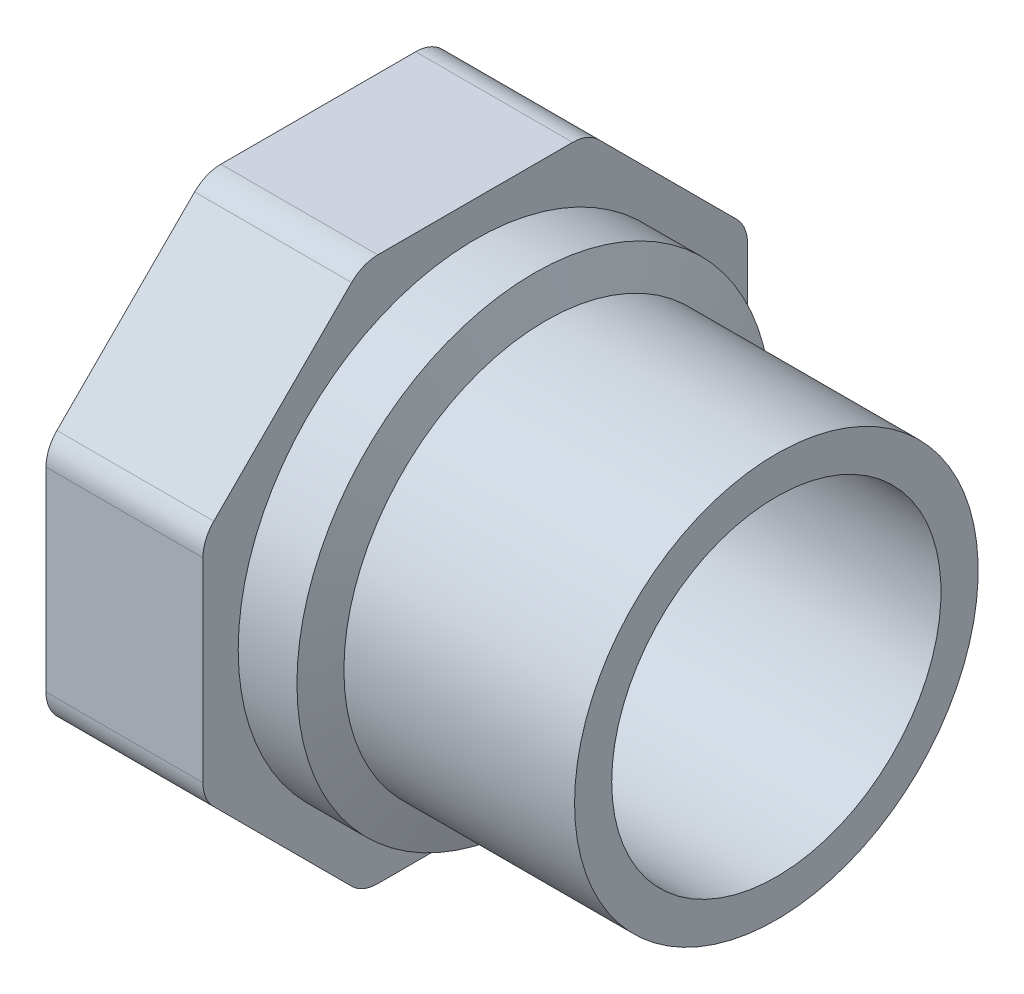
ISO-10303-21;
HEADER;
FILE_DESCRIPTION(('STEP AP214'),'2;1');
FILE_NAME('part.step','',(''),(''),'','','');
FILE_SCHEMA(('AUTOMOTIVE_DESIGN { 1 0 10303 214 1 1 1 1 }'));
ENDSEC;
DATA;
#1=APPLICATION_CONTEXT('core data for automotive mechanical design processes');
#2=APPLICATION_PROTOCOL_DEFINITION('international standard','automotive_design',2000,#1);
#3=PRODUCT_CONTEXT('',#1,'mechanical');
#4=PRODUCT('Part','Part','',(#3));
#5=PRODUCT_RELATED_PRODUCT_CATEGORY('part','',(#4));
#6=PRODUCT_DEFINITION_FORMATION('','',#4);
#7=PRODUCT_DEFINITION_CONTEXT('part definition',#1,'design');
#8=PRODUCT_DEFINITION('design','',#6,#7);
#9=PRODUCT_DEFINITION_SHAPE('','',#8);
#10=(LENGTH_UNIT() NAMED_UNIT(*) SI_UNIT(.MILLI.,.METRE.));
#11=(NAMED_UNIT(*) PLANE_ANGLE_UNIT() SI_UNIT($,.RADIAN.));
#12=(NAMED_UNIT(*) SI_UNIT($,.STERADIAN.) SOLID_ANGLE_UNIT());
#13=UNCERTAINTY_MEASURE_WITH_UNIT(LENGTH_MEASURE(1.E-05),#10,'distance_accuracy_value','');
#14=(GEOMETRIC_REPRESENTATION_CONTEXT(3) GLOBAL_UNCERTAINTY_ASSIGNED_CONTEXT((#13)) GLOBAL_UNIT_ASSIGNED_CONTEXT((#10,
#11,#12)) REPRESENTATION_CONTEXT('',''));
#15=CARTESIAN_POINT('',(0.,0.,0.));
#16=DIRECTION('',(0.,0.,1.));
#17=DIRECTION('',(1.,0.,0.));
#18=AXIS2_PLACEMENT_3D('',#15,#16,#17);
#19=CARTESIAN_POINT('',(-36.,0.,0.));
#20=DIRECTION('',(-1.,0.,0.));
#21=DIRECTION('',(0.,0.,1.));
#22=AXIS2_PLACEMENT_3D('',#19,#20,#21);
#23=CYLINDRICAL_SURFACE('',#22,31.5);
#24=CARTESIAN_POINT('',(-36.,0.,0.));
#25=DIRECTION('',(1.,0.,0.));
#26=DIRECTION('',(0.,1.,0.));
#27=AXIS2_PLACEMENT_3D('',#24,#25,#26);
#28=CIRCLE('',#27,31.5);
#29=CARTESIAN_POINT('',(-36.,31.5,0.));
#30=VERTEX_POINT('',#29);
#31=EDGE_CURVE('E193',#30,#30,#28,.F.);
#32=ORIENTED_EDGE('',*,*,#31,.F.);
#33=EDGE_LOOP('',(#32));
#34=FACE_BOUND('',#33,.T.);
#35=CARTESIAN_POINT('',(0.,0.,0.));
#36=DIRECTION('',(-1.,0.,0.));
#37=DIRECTION('',(0.,0.,1.));
#38=AXIS2_PLACEMENT_3D('',#35,#36,#37);
#39=CIRCLE('',#38,31.5);
#40=CARTESIAN_POINT('',(0.,0.,31.5));
#41=VERTEX_POINT('',#40);
#42=EDGE_CURVE('E18',#41,#41,#39,.F.);
#43=ORIENTED_EDGE('',*,*,#42,.F.);
#44=EDGE_LOOP('',(#43));
#45=FACE_BOUND('',#44,.T.);
#46=ADVANCED_FACE('F15',(#34,#45),#23,.T.);
#47=CARTESIAN_POINT('',(-36.,0.,0.));
#48=DIRECTION('',(-1.,0.,0.));
#49=DIRECTION('',(0.,0.,1.));
#50=AXIS2_PLACEMENT_3D('',#47,#48,#49);
#51=CONICAL_SURFACE('',#50,31.5,1.24904577239825);
#52=CARTESIAN_POINT('',(-37.8333333333333,0.,0.));
#53=DIRECTION('',(-1.,0.,0.));
#54=DIRECTION('',(0.,1.,0.));
#55=AXIS2_PLACEMENT_3D('',#52,#53,#54);
#56=CIRCLE('',#55,37.);
#57=CARTESIAN_POINT('',(-37.8333333333333,37.,0.));
#58=VERTEX_POINT('',#57);
#59=EDGE_CURVE('E189',#58,#58,#56,.T.);
#60=ORIENTED_EDGE('',*,*,#59,.F.);
#61=EDGE_LOOP('',(#60));
#62=FACE_BOUND('',#61,.T.);
#63=ORIENTED_EDGE('',*,*,#31,.T.);
#64=EDGE_LOOP('',(#63));
#65=FACE_BOUND('',#64,.T.);
#66=ADVANCED_FACE('F268',(#62,#65),#51,.T.);
#67=CARTESIAN_POINT('',(0.,31.5,31.8780010540613));
#68=DIRECTION('',(1.,0.,0.));
#69=DIRECTION('',(0.,-1.,0.));
#70=AXIS2_PLACEMENT_3D('',#67,#68,#69);
#71=PLANE('',#70);
#72=CARTESIAN_POINT('',(0.,0.,0.));
#73=DIRECTION('',(-1.,0.,0.));
#74=DIRECTION('',(0.,0.,1.));
#75=AXIS2_PLACEMENT_3D('',#72,#73,#74);
#76=CIRCLE('',#75,25.7);
#77=CARTESIAN_POINT('',(0.,0.,25.7));
#78=VERTEX_POINT('',#77);
#79=EDGE_CURVE('E192',#78,#78,#76,.F.);
#80=ORIENTED_EDGE('',*,*,#79,.F.);
#81=EDGE_LOOP('',(#80));
#82=FACE_BOUND('',#81,.T.);
#83=ORIENTED_EDGE('',*,*,#42,.T.);
#84=EDGE_LOOP('',(#83));
#85=FACE_BOUND('',#84,.T.);
#86=ADVANCED_FACE('F264',(#82,#85),#71,.T.);
#87=CARTESIAN_POINT('',(-47.,0.,0.));
#88=DIRECTION('',(-1.,0.,0.));
#89=DIRECTION('',(0.,0.,1.));
#90=AXIS2_PLACEMENT_3D('',#87,#88,#89);
#91=CYLINDRICAL_SURFACE('',#90,37.);
#92=CARTESIAN_POINT('',(-47.,0.,0.));
#93=DIRECTION('',(-1.,0.,0.));
#94=DIRECTION('',(0.,0.,1.));
#95=AXIS2_PLACEMENT_3D('',#92,#93,#94);
#96=CIRCLE('',#95,37.);
#97=CARTESIAN_POINT('',(-47.,0.,37.));
#98=VERTEX_POINT('',#97);
#99=EDGE_CURVE('E188',#98,#98,#96,.T.);
#100=ORIENTED_EDGE('',*,*,#99,.F.);
#101=EDGE_LOOP('',(#100));
#102=FACE_BOUND('',#101,.T.);
#103=ORIENTED_EDGE('',*,*,#59,.T.);
#104=EDGE_LOOP('',(#103));
#105=FACE_BOUND('',#104,.T.);
#106=ADVANCED_FACE('F267',(#102,#105),#91,.T.);
#107=CARTESIAN_POINT('',(0.,0.,0.));
#108=DIRECTION('',(-1.,0.,0.));
#109=DIRECTION('',(0.,0.,1.));
#110=AXIS2_PLACEMENT_3D('',#107,#108,#109);
#111=CYLINDRICAL_SURFACE('',#110,25.7);
#112=ORIENTED_EDGE('',*,*,#79,.T.);
#113=EDGE_LOOP('',(#112));
#114=FACE_BOUND('',#113,.T.);
#115=CARTESIAN_POINT('',(-46.1528349610431,0.,0.));
#116=DIRECTION('',(1.,0.,0.));
#117=DIRECTION('',(0.,1.,0.));
#118=AXIS2_PLACEMENT_3D('',#115,#116,#117);
#119=CIRCLE('',#118,25.7);
#120=CARTESIAN_POINT('',(-46.1528349610431,25.7,0.));
#121=VERTEX_POINT('',#120);
#122=EDGE_CURVE('E135',#121,#121,#119,.T.);
#123=ORIENTED_EDGE('',*,*,#122,.F.);
#124=EDGE_LOOP('',(#123));
#125=FACE_BOUND('',#124,.T.);
#126=ADVANCED_FACE('F261',(#114,#125),#111,.F.);
#127=CARTESIAN_POINT('',(-47.,42.5,42.5));
#128=DIRECTION('',(1.,0.,0.));
#129=DIRECTION('',(0.,-1.,0.));
#130=AXIS2_PLACEMENT_3D('',#127,#128,#129);
#131=PLANE('',#130);
#132=ORIENTED_EDGE('',*,*,#99,.T.);
#133=EDGE_LOOP('',(#132));
#134=FACE_BOUND('',#133,.T.);
#135=CARTESIAN_POINT('',(-47.,15.2016377390926,36.7));
#136=DIRECTION('',(1.,0.,0.));
#137=DIRECTION('',(0.,0.,-1.));
#138=AXIS2_PLACEMENT_3D('',#135,#136,#137);
#139=CIRCLE('',#138,5.79999999999997);
#140=CARTESIAN_POINT('',(-47.,15.2016377390926,42.5));
#141=VERTEX_POINT('',#140);
#142=CARTESIAN_POINT('',(-47.,19.3028570699746,40.801219330882));
#143=VERTEX_POINT('',#142);
#144=EDGE_CURVE('E254',#141,#143,#139,.F.);
#145=ORIENTED_EDGE('',*,*,#144,.F.);
#146=DIRECTION('',(0.,1.,0.));
#147=VECTOR('',#146,1.);
#148=CARTESIAN_POINT('',(-47.,0.,42.5));
#149=LINE('',#148,#147);
#150=CARTESIAN_POINT('',(-47.,-15.2016377390926,42.5));
#151=VERTEX_POINT('',#150);
#152=EDGE_CURVE('E132',#151,#141,#149,.T.);
#153=ORIENTED_EDGE('',*,*,#152,.F.);
#154=CARTESIAN_POINT('',(-47.,-15.2016377390926,36.7));
#155=DIRECTION('',(1.,0.,0.));
#156=DIRECTION('',(0.,0.,-1.));
#157=AXIS2_PLACEMENT_3D('',#154,#155,#156);
#158=CIRCLE('',#157,5.79999999999998);
#159=CARTESIAN_POINT('',(-47.,-19.3028570699746,40.801219330882));
#160=VERTEX_POINT('',#159);
#161=EDGE_CURVE('E126',#160,#151,#158,.F.);
#162=ORIENTED_EDGE('',*,*,#161,.F.);
#163=DIRECTION('',(0.,0.707106781186547,0.707106781186548));
#164=VECTOR('',#163,1.);
#165=CARTESIAN_POINT('',(-47.,-30.0520382004283,30.0520382004283));
#166=LINE('',#165,#164);
#167=CARTESIAN_POINT('',(-47.,-40.801219330882,19.3028570699745));
#168=VERTEX_POINT('',#167);
#169=EDGE_CURVE('E130',#168,#160,#166,.T.);
#170=ORIENTED_EDGE('',*,*,#169,.F.);
#171=CARTESIAN_POINT('',(-47.,-36.7,15.2016377390926));
#172=DIRECTION('',(1.,0.,0.));
#173=DIRECTION('',(0.,0.,-1.));
#174=AXIS2_PLACEMENT_3D('',#171,#172,#173);
#175=CIRCLE('',#174,5.8);
#176=CARTESIAN_POINT('',(-47.,-42.5,15.2016377390926));
#177=VERTEX_POINT('',#176);
#178=EDGE_CURVE('E149',#177,#168,#175,.F.);
#179=ORIENTED_EDGE('',*,*,#178,.F.);
#180=DIRECTION('',(0.,0.,1.));
#181=VECTOR('',#180,1.);
#182=CARTESIAN_POINT('',(-47.,-42.5,0.));
#183=LINE('',#182,#181);
#184=CARTESIAN_POINT('',(-47.,-42.5,-15.2016377390926));
#185=VERTEX_POINT('',#184);
#186=EDGE_CURVE('E154',#185,#177,#183,.T.);
#187=ORIENTED_EDGE('',*,*,#186,.F.);
#188=CARTESIAN_POINT('',(-47.,-36.7,-15.2016377390926));
#189=DIRECTION('',(1.,0.,0.));
#190=DIRECTION('',(0.,0.,-1.));
#191=AXIS2_PLACEMENT_3D('',#188,#189,#190);
#192=CIRCLE('',#191,5.8);
#193=CARTESIAN_POINT('',(-47.,-40.801219330882,-19.3028570699746));
#194=VERTEX_POINT('',#193);
#195=EDGE_CURVE('E239',#194,#185,#192,.F.);
#196=ORIENTED_EDGE('',*,*,#195,.F.);
#197=DIRECTION('',(0.,-0.707106781186548,0.707106781186547));
#198=VECTOR('',#197,1.);
#199=CARTESIAN_POINT('',(-47.,-30.0520382004282,-30.0520382004283));
#200=LINE('',#199,#198);
#201=CARTESIAN_POINT('',(-47.,-19.3028570699745,-40.801219330882));
#202=VERTEX_POINT('',#201);
#203=EDGE_CURVE('E159',#202,#194,#200,.T.);
#204=ORIENTED_EDGE('',*,*,#203,.F.);
#205=CARTESIAN_POINT('',(-47.,-15.2016377390926,-36.7));
#206=DIRECTION('',(1.,0.,0.));
#207=DIRECTION('',(0.,0.,-1.));
#208=AXIS2_PLACEMENT_3D('',#205,#206,#207);
#209=CIRCLE('',#208,5.80000000000003);
#210=CARTESIAN_POINT('',(-47.,-15.2016377390926,-42.5));
#211=VERTEX_POINT('',#210);
#212=EDGE_CURVE('E242',#211,#202,#209,.F.);
#213=ORIENTED_EDGE('',*,*,#212,.F.);
#214=DIRECTION('',(0.,-1.,0.));
#215=VECTOR('',#214,1.);
#216=CARTESIAN_POINT('',(-47.,0.,-42.5));
#217=LINE('',#216,#215);
#218=CARTESIAN_POINT('',(-47.,15.2016377390926,-42.5));
#219=VERTEX_POINT('',#218);
#220=EDGE_CURVE('E164',#219,#211,#217,.T.);
#221=ORIENTED_EDGE('',*,*,#220,.F.);
#222=CARTESIAN_POINT('',(-47.,15.2016377390926,-36.7000000000001));
#223=DIRECTION('',(1.,0.,0.));
#224=DIRECTION('',(0.,0.,-1.));
#225=AXIS2_PLACEMENT_3D('',#222,#223,#224);
#226=CIRCLE('',#225,5.79999999999994);
#227=CARTESIAN_POINT('',(-47.,19.3028570699746,-40.801219330882));
#228=VERTEX_POINT('',#227);
#229=EDGE_CURVE('E245',#228,#219,#226,.F.);
#230=ORIENTED_EDGE('',*,*,#229,.F.);
#231=DIRECTION('',(0.,-0.707106781186547,-0.707106781186548));
#232=VECTOR('',#231,1.);
#233=CARTESIAN_POINT('',(-47.,30.0520382004283,-30.0520382004283));
#234=LINE('',#233,#232);
#235=CARTESIAN_POINT('',(-47.,40.801219330882,-19.3028570699746));
#236=VERTEX_POINT('',#235);
#237=EDGE_CURVE('E169',#236,#228,#234,.T.);
#238=ORIENTED_EDGE('',*,*,#237,.F.);
#239=CARTESIAN_POINT('',(-47.,36.7,-15.2016377390926));
#240=DIRECTION('',(1.,0.,0.));
#241=DIRECTION('',(0.,0.,-1.));
#242=AXIS2_PLACEMENT_3D('',#239,#240,#241);
#243=CIRCLE('',#242,5.80000000000001);
#244=CARTESIAN_POINT('',(-47.,42.5,-15.2016377390926));
#245=VERTEX_POINT('',#244);
#246=EDGE_CURVE('E248',#245,#236,#243,.F.);
#247=ORIENTED_EDGE('',*,*,#246,.F.);
#248=DIRECTION('',(0.,0.,-1.));
#249=VECTOR('',#248,1.);
#250=CARTESIAN_POINT('',(-47.,42.5,0.));
#251=LINE('',#250,#249);
#252=CARTESIAN_POINT('',(-47.,42.5,15.2016377390926));
#253=VERTEX_POINT('',#252);
#254=EDGE_CURVE('E174',#253,#245,#251,.T.);
#255=ORIENTED_EDGE('',*,*,#254,.F.);
#256=CARTESIAN_POINT('',(-47.,36.7,15.2016377390926));
#257=DIRECTION('',(1.,0.,0.));
#258=DIRECTION('',(0.,0.,-1.));
#259=AXIS2_PLACEMENT_3D('',#256,#257,#258);
#260=CIRCLE('',#259,5.8);
#261=CARTESIAN_POINT('',(-47.,40.801219330882,19.3028570699746));
#262=VERTEX_POINT('',#261);
#263=EDGE_CURVE('E251',#262,#253,#260,.F.);
#264=ORIENTED_EDGE('',*,*,#263,.F.);
#265=DIRECTION('',(0.,0.707106781186548,-0.707106781186547));
#266=VECTOR('',#265,1.);
#267=CARTESIAN_POINT('',(-47.,30.0520382004283,30.0520382004283));
#268=LINE('',#267,#266);
#269=EDGE_CURVE('E179',#143,#262,#268,.T.);
#270=ORIENTED_EDGE('',*,*,#269,.F.);
#271=EDGE_LOOP('',(#145,#153,#162,#170,#179,#187,#196,#204,#213,#221,#230,#238,#247,#255,#264,#270));
#272=FACE_BOUND('',#271,.T.);
#273=ADVANCED_FACE('F128',(#134,#272),#131,.T.);
#274=CARTESIAN_POINT('',(-47.,0.,0.));
#275=DIRECTION('',(-1.,0.,0.));
#276=DIRECTION('',(0.,0.,1.));
#277=AXIS2_PLACEMENT_3D('',#274,#275,#276);
#278=CONICAL_SURFACE('',#277,27.1673328898693,1.04719755119659);
#279=ORIENTED_EDGE('',*,*,#122,.T.);
#280=EDGE_LOOP('',(#279));
#281=FACE_BOUND('',#280,.T.);
#282=CARTESIAN_POINT('',(-47.,0.,0.));
#283=DIRECTION('',(1.,0.,0.));
#284=DIRECTION('',(0.,1.,0.));
#285=AXIS2_PLACEMENT_3D('',#282,#283,#284);
#286=CIRCLE('',#285,27.1673328898693);
#287=CARTESIAN_POINT('',(-47.,27.1673328898693,0.));
#288=VERTEX_POINT('',#287);
#289=EDGE_CURVE('E153',#288,#288,#286,.T.);
#290=ORIENTED_EDGE('',*,*,#289,.F.);
#291=EDGE_LOOP('',(#290));
#292=FACE_BOUND('',#291,.T.);
#293=ADVANCED_FACE('F438',(#281,#292),#278,.F.);
#294=CARTESIAN_POINT('',(-47.,-15.2016377390926,36.7));
#295=DIRECTION('',(1.,0.,0.));
#296=DIRECTION('',(0.,0.,-1.));
#297=AXIS2_PLACEMENT_3D('',#294,#295,#296);
#298=CYLINDRICAL_SURFACE('',#297,5.79999999999998);
#299=CARTESIAN_POINT('',(-71.5,-15.2016377390926,36.7));
#300=DIRECTION('',(1.,0.,0.));
#301=DIRECTION('',(0.,0.,-1.));
#302=AXIS2_PLACEMENT_3D('',#299,#300,#301);
#303=CIRCLE('',#302,5.79999999999998);
#304=CARTESIAN_POINT('',(-71.5,-19.3028570699746,40.801219330882));
#305=VERTEX_POINT('',#304);
#306=CARTESIAN_POINT('',(-71.5,-15.2016377390926,42.5));
#307=VERTEX_POINT('',#306);
#308=EDGE_CURVE('E141',#305,#307,#303,.F.);
#309=ORIENTED_EDGE('',*,*,#308,.F.);
#310=DIRECTION('',(1.,0.,0.));
#311=VECTOR('',#310,1.);
#312=CARTESIAN_POINT('',(-71.5,-19.3028570699746,40.801219330882));
#313=LINE('',#312,#311);
#314=EDGE_CURVE('E138',#160,#305,#313,.F.);
#315=ORIENTED_EDGE('',*,*,#314,.F.);
#316=ORIENTED_EDGE('',*,*,#161,.T.);
#317=DIRECTION('',(1.,0.,0.));
#318=VECTOR('',#317,1.);
#319=CARTESIAN_POINT('',(-71.5,-15.2016377390926,42.5));
#320=LINE('',#319,#318);
#321=EDGE_CURVE('E185',#307,#151,#320,.T.);
#322=ORIENTED_EDGE('',*,*,#321,.F.);
#323=EDGE_LOOP('',(#309,#315,#316,#322));
#324=FACE_BOUND('',#323,.T.);
#325=ADVANCED_FACE('F139',(#324),#298,.T.);
#326=CARTESIAN_POINT('',(-71.5,15.2016377390926,42.5));
#327=DIRECTION('',(0.,0.,1.));
#328=DIRECTION('',(0.,-1.,0.));
#329=AXIS2_PLACEMENT_3D('',#326,#327,#328);
#330=PLANE('',#329);
#331=DIRECTION('',(0.,1.,0.));
#332=VECTOR('',#331,1.);
#333=CARTESIAN_POINT('',(-71.5,0.,42.5));
#334=LINE('',#333,#332);
#335=CARTESIAN_POINT('',(-71.5,15.2016377390926,42.5));
#336=VERTEX_POINT('',#335);
#337=EDGE_CURVE('E236',#307,#336,#334,.T.);
#338=ORIENTED_EDGE('',*,*,#337,.F.);
#339=ORIENTED_EDGE('',*,*,#321,.T.);
#340=ORIENTED_EDGE('',*,*,#152,.T.);
#341=DIRECTION('',(1.,0.,0.));
#342=VECTOR('',#341,1.);
#343=CARTESIAN_POINT('',(-59.25,15.2016377390926,42.5));
#344=LINE('',#343,#342);
#345=EDGE_CURVE('E183',#336,#141,#344,.T.);
#346=ORIENTED_EDGE('',*,*,#345,.F.);
#347=EDGE_LOOP('',(#338,#339,#340,#346));
#348=FACE_BOUND('',#347,.T.);
#349=ADVANCED_FACE('F387',(#348),#330,.T.);
#350=CARTESIAN_POINT('',(-47.,15.2016377390926,36.7));
#351=DIRECTION('',(1.,0.,0.));
#352=DIRECTION('',(0.,0.,-1.));
#353=AXIS2_PLACEMENT_3D('',#350,#351,#352);
#354=CYLINDRICAL_SURFACE('',#353,5.79999999999997);
#355=CARTESIAN_POINT('',(-71.5,15.2016377390926,36.7));
#356=DIRECTION('',(1.,0.,0.));
#357=DIRECTION('',(0.,0.,-1.));
#358=AXIS2_PLACEMENT_3D('',#355,#356,#357);
#359=CIRCLE('',#358,5.79999999999997);
#360=CARTESIAN_POINT('',(-71.5,19.3028570699746,40.801219330882));
#361=VERTEX_POINT('',#360);
#362=EDGE_CURVE('E233',#336,#361,#359,.F.);
#363=ORIENTED_EDGE('',*,*,#362,.F.);
#364=ORIENTED_EDGE('',*,*,#345,.T.);
#365=ORIENTED_EDGE('',*,*,#144,.T.);
#366=DIRECTION('',(1.,0.,0.));
#367=VECTOR('',#366,1.);
#368=CARTESIAN_POINT('',(-71.5,19.3028570699746,40.801219330882));
#369=LINE('',#368,#367);
#370=EDGE_CURVE('E182',#361,#143,#369,.T.);
#371=ORIENTED_EDGE('',*,*,#370,.F.);
#372=EDGE_LOOP('',(#363,#364,#365,#371));
#373=FACE_BOUND('',#372,.T.);
#374=ADVANCED_FACE('F425',(#373),#354,.T.);
#375=CARTESIAN_POINT('',(-71.5,40.801219330882,19.3028570699746));
#376=DIRECTION('',(0.,0.707106781186547,0.707106781186548));
#377=DIRECTION('',(0.,-0.707106781186548,0.707106781186547));
#378=AXIS2_PLACEMENT_3D('',#375,#376,#377);
#379=PLANE('',#378);
#380=CARTESIAN_POINT('',(-71.5,19.3028570699746,40.801219330882));
#381=CARTESIAN_POINT('',(-71.5,20.1986221641791,39.9054542366775));
#382=CARTESIAN_POINT('',(-71.5,21.0943872583835,39.0096891424731));
#383=CARTESIAN_POINT('',(-71.5,22.8859174467925,37.2181589540641));
#384=CARTESIAN_POINT('',(-71.5,23.7816825409969,36.3223938598596));
#385=CARTESIAN_POINT('',(-71.5,25.5732127294059,34.5308636714507));
#386=CARTESIAN_POINT('',(-71.5,26.4689778236104,33.6350985772462));
#387=CARTESIAN_POINT('',(-71.5,28.2605080120193,31.8435683888372));
#388=CARTESIAN_POINT('',(-71.5,29.1562731062238,30.9478032946328));
#389=CARTESIAN_POINT('',(-71.5,30.9478032946327,29.1562731062238));
#390=CARTESIAN_POINT('',(-71.5,31.8435683888372,28.2605080120193));
#391=CARTESIAN_POINT('',(-71.5,33.6350985772462,26.4689778236104));
#392=CARTESIAN_POINT('',(-71.5,34.5308636714507,25.5732127294059));
#393=CARTESIAN_POINT('',(-71.5,36.3223938598596,23.781682540997));
#394=CARTESIAN_POINT('',(-71.5,37.2181589540641,22.8859174467925));
#395=CARTESIAN_POINT('',(-71.5,39.009689142473,21.0943872583835));
#396=CARTESIAN_POINT('',(-71.5,39.9054542366775,20.198622164179));
#397=CARTESIAN_POINT('',(-71.5,40.801219330882,19.3028570699746));
#398=B_SPLINE_CURVE_WITH_KNOTS('',3,(#380,#381,#382,#383,#384,#385,#386,#387,#388,#389,#390,
#391,#392,#393,#394,#395,#396,#397),.UNSPECIFIED.,.F.,.F.,(4,2,2,2,2,2,2,2,4),(0.,
3.80040943477315,7.60081886954629,11.4012283043195,15.2016377390926,19.0020471738657,
22.8024566086389,26.602866043412,30.4032754781852),.UNSPECIFIED.);
#399=CARTESIAN_POINT('',(-71.5,40.801219330882,19.3028570699746));
#400=VERTEX_POINT('',#399);
#401=EDGE_CURVE('E232',#361,#400,#398,.T.);
#402=ORIENTED_EDGE('',*,*,#401,.F.);
#403=ORIENTED_EDGE('',*,*,#370,.T.);
#404=ORIENTED_EDGE('',*,*,#269,.T.);
#405=DIRECTION('',(1.,0.,0.));
#406=VECTOR('',#405,1.);
#407=CARTESIAN_POINT('',(-59.25,40.801219330882,19.3028570699746));
#408=LINE('',#407,#406);
#409=EDGE_CURVE('E178',#400,#262,#408,.T.);
#410=ORIENTED_EDGE('',*,*,#409,.F.);
#411=EDGE_LOOP('',(#402,#403,#404,#410));
#412=FACE_BOUND('',#411,.T.);
#413=ADVANCED_FACE('F423',(#412),#379,.T.);
#414=CARTESIAN_POINT('',(-47.,36.7,15.2016377390926));
#415=DIRECTION('',(1.,0.,0.));
#416=DIRECTION('',(0.,0.,-1.));
#417=AXIS2_PLACEMENT_3D('',#414,#415,#416);
#418=CYLINDRICAL_SURFACE('',#417,5.8);
#419=CARTESIAN_POINT('',(-71.5,36.7,15.2016377390926));
#420=DIRECTION('',(1.,0.,0.));
#421=DIRECTION('',(0.,0.,-1.));
#422=AXIS2_PLACEMENT_3D('',#419,#420,#421);
#423=CIRCLE('',#422,5.8);
#424=CARTESIAN_POINT('',(-71.5,42.5,15.2016377390926));
#425=VERTEX_POINT('',#424);
#426=EDGE_CURVE('E229',#400,#425,#423,.F.);
#427=ORIENTED_EDGE('',*,*,#426,.F.);
#428=ORIENTED_EDGE('',*,*,#409,.T.);
#429=ORIENTED_EDGE('',*,*,#263,.T.);
#430=DIRECTION('',(1.,0.,0.));
#431=VECTOR('',#430,1.);
#432=CARTESIAN_POINT('',(-71.5,42.5,15.2016377390926));
#433=LINE('',#432,#431);
#434=EDGE_CURVE('E177',#425,#253,#433,.T.);
#435=ORIENTED_EDGE('',*,*,#434,.F.);
#436=EDGE_LOOP('',(#427,#428,#429,#435));
#437=FACE_BOUND('',#436,.T.);
#438=ADVANCED_FACE('F420',(#437),#418,.T.);
#439=CARTESIAN_POINT('',(-71.5,42.5,-15.2016377390926));
#440=DIRECTION('',(0.,1.,0.));
#441=DIRECTION('',(0.,0.,1.));
#442=AXIS2_PLACEMENT_3D('',#439,#440,#441);
#443=PLANE('',#442);
#444=DIRECTION('',(0.,0.,-1.));
#445=VECTOR('',#444,1.);
#446=CARTESIAN_POINT('',(-71.5,42.5,42.5));
#447=LINE('',#446,#445);
#448=CARTESIAN_POINT('',(-71.5,42.5,-15.2016377390926));
#449=VERTEX_POINT('',#448);
#450=EDGE_CURVE('E228',#425,#449,#447,.T.);
#451=ORIENTED_EDGE('',*,*,#450,.F.);
#452=ORIENTED_EDGE('',*,*,#434,.T.);
#453=ORIENTED_EDGE('',*,*,#254,.T.);
#454=DIRECTION('',(1.,0.,0.));
#455=VECTOR('',#454,1.);
#456=CARTESIAN_POINT('',(-59.25,42.5,-15.2016377390926));
#457=LINE('',#456,#455);
#458=EDGE_CURVE('E173',#449,#245,#457,.T.);
#459=ORIENTED_EDGE('',*,*,#458,.F.);
#460=EDGE_LOOP('',(#451,#452,#453,#459));
#461=FACE_BOUND('',#460,.T.);
#462=ADVANCED_FACE('F417',(#461),#443,.T.);
#463=CARTESIAN_POINT('',(-47.,36.7,-15.2016377390926));
#464=DIRECTION('',(1.,0.,0.));
#465=DIRECTION('',(0.,0.,-1.));
#466=AXIS2_PLACEMENT_3D('',#463,#464,#465);
#467=CYLINDRICAL_SURFACE('',#466,5.80000000000001);
#468=CARTESIAN_POINT('',(-71.5,36.7,-15.2016377390926));
#469=DIRECTION('',(1.,0.,0.));
#470=DIRECTION('',(0.,0.,-1.));
#471=AXIS2_PLACEMENT_3D('',#468,#469,#470);
#472=CIRCLE('',#471,5.80000000000001);
#473=CARTESIAN_POINT('',(-71.5,40.801219330882,-19.3028570699745));
#474=VERTEX_POINT('',#473);
#475=EDGE_CURVE('E225',#449,#474,#472,.F.);
#476=ORIENTED_EDGE('',*,*,#475,.F.);
#477=ORIENTED_EDGE('',*,*,#458,.T.);
#478=ORIENTED_EDGE('',*,*,#246,.T.);
#479=DIRECTION('',(1.,0.,0.));
#480=VECTOR('',#479,1.);
#481=CARTESIAN_POINT('',(-71.5,40.801219330882,-19.3028570699745));
#482=LINE('',#481,#480);
#483=EDGE_CURVE('E172',#474,#236,#482,.T.);
#484=ORIENTED_EDGE('',*,*,#483,.F.);
#485=EDGE_LOOP('',(#476,#477,#478,#484));
#486=FACE_BOUND('',#485,.T.);
#487=ADVANCED_FACE('F414',(#486),#467,.T.);
#488=CARTESIAN_POINT('',(-71.5,19.3028570699746,-40.801219330882));
#489=DIRECTION('',(0.,0.707106781186548,-0.707106781186547));
#490=DIRECTION('',(0.,0.707106781186547,0.707106781186548));
#491=AXIS2_PLACEMENT_3D('',#488,#489,#490);
#492=PLANE('',#491);
#493=CARTESIAN_POINT('',(-71.5,40.801219330882,-19.3028570699745));
#494=CARTESIAN_POINT('',(-71.5,39.9054542366775,-20.198622164179));
#495=CARTESIAN_POINT('',(-71.5,39.009689142473,-21.0943872583835));
#496=CARTESIAN_POINT('',(-71.5,37.2181589540641,-22.8859174467924));
#497=CARTESIAN_POINT('',(-71.5,36.3223938598596,-23.7816825409969));
#498=CARTESIAN_POINT('',(-71.5,34.5308636714507,-25.5732127294059));
#499=CARTESIAN_POINT('',(-71.5,33.6350985772462,-26.4689778236104));
#500=CARTESIAN_POINT('',(-71.5,31.8435683888372,-28.2605080120193));
#501=CARTESIAN_POINT('',(-71.5,30.9478032946328,-29.1562731062238));
#502=CARTESIAN_POINT('',(-71.5,29.1562731062238,-30.9478032946327));
#503=CARTESIAN_POINT('',(-71.5,28.2605080120193,-31.8435683888372));
#504=CARTESIAN_POINT('',(-71.5,26.4689778236104,-33.6350985772462));
#505=CARTESIAN_POINT('',(-71.5,25.5732127294059,-34.5308636714506));
#506=CARTESIAN_POINT('',(-71.5,23.781682540997,-36.3223938598596));
#507=CARTESIAN_POINT('',(-71.5,22.8859174467925,-37.2181589540641));
#508=CARTESIAN_POINT('',(-71.5,21.0943872583835,-39.0096891424731));
#509=CARTESIAN_POINT('',(-71.5,20.1986221641791,-39.9054542366775));
#510=CARTESIAN_POINT('',(-71.5,19.3028570699746,-40.801219330882));
#511=B_SPLINE_CURVE_WITH_KNOTS('',3,(#493,#494,#495,#496,#497,#498,#499,#500,#501,#502,#503,
#504,#505,#506,#507,#508,#509,#510),.UNSPECIFIED.,.F.,.F.,(4,2,2,2,2,2,2,2,4),(0.,
3.80040943477314,7.6008188695463,11.4012283043195,15.2016377390926,19.0020471738657,
22.8024566086389,26.6028660434121,30.4032754781852),.UNSPECIFIED.);
#512=CARTESIAN_POINT('',(-71.5,19.3028570699746,-40.801219330882));
#513=VERTEX_POINT('',#512);
#514=EDGE_CURVE('E224',#474,#513,#511,.T.);
#515=ORIENTED_EDGE('',*,*,#514,.F.);
#516=ORIENTED_EDGE('',*,*,#483,.T.);
#517=ORIENTED_EDGE('',*,*,#237,.T.);
#518=DIRECTION('',(1.,0.,0.));
#519=VECTOR('',#518,1.);
#520=CARTESIAN_POINT('',(-59.25,19.3028570699746,-40.801219330882));
#521=LINE('',#520,#519);
#522=EDGE_CURVE('E168',#513,#228,#521,.T.);
#523=ORIENTED_EDGE('',*,*,#522,.F.);
#524=EDGE_LOOP('',(#515,#516,#517,#523));
#525=FACE_BOUND('',#524,.T.);
#526=ADVANCED_FACE('F411',(#525),#492,.T.);
#527=CARTESIAN_POINT('',(-47.,15.2016377390926,-36.7000000000001));
#528=DIRECTION('',(1.,0.,0.));
#529=DIRECTION('',(0.,0.,-1.));
#530=AXIS2_PLACEMENT_3D('',#527,#528,#529);
#531=CYLINDRICAL_SURFACE('',#530,5.79999999999994);
#532=CARTESIAN_POINT('',(-71.5,15.2016377390926,-36.7000000000001));
#533=DIRECTION('',(1.,0.,0.));
#534=DIRECTION('',(0.,0.,-1.));
#535=AXIS2_PLACEMENT_3D('',#532,#533,#534);
#536=CIRCLE('',#535,5.79999999999994);
#537=CARTESIAN_POINT('',(-71.5,15.2016377390926,-42.5));
#538=VERTEX_POINT('',#537);
#539=EDGE_CURVE('E221',#513,#538,#536,.F.);
#540=ORIENTED_EDGE('',*,*,#539,.F.);
#541=ORIENTED_EDGE('',*,*,#522,.T.);
#542=ORIENTED_EDGE('',*,*,#229,.T.);
#543=DIRECTION('',(1.,0.,0.));
#544=VECTOR('',#543,1.);
#545=CARTESIAN_POINT('',(-71.5,15.2016377390926,-42.5));
#546=LINE('',#545,#544);
#547=EDGE_CURVE('E167',#538,#219,#546,.T.);
#548=ORIENTED_EDGE('',*,*,#547,.F.);
#549=EDGE_LOOP('',(#540,#541,#542,#548));
#550=FACE_BOUND('',#549,.T.);
#551=ADVANCED_FACE('F408',(#550),#531,.T.);
#552=CARTESIAN_POINT('',(-71.5,-15.2016377390926,-42.5));
#553=DIRECTION('',(0.,0.,-1.));
#554=DIRECTION('',(0.,1.,0.));
#555=AXIS2_PLACEMENT_3D('',#552,#553,#554);
#556=PLANE('',#555);
#557=DIRECTION('',(0.,-1.,0.));
#558=VECTOR('',#557,1.);
#559=CARTESIAN_POINT('',(-71.5,0.,-42.5));
#560=LINE('',#559,#558);
#561=CARTESIAN_POINT('',(-71.5,-15.2016377390926,-42.5));
#562=VERTEX_POINT('',#561);
#563=EDGE_CURVE('E220',#538,#562,#560,.T.);
#564=ORIENTED_EDGE('',*,*,#563,.F.);
#565=ORIENTED_EDGE('',*,*,#547,.T.);
#566=ORIENTED_EDGE('',*,*,#220,.T.);
#567=DIRECTION('',(1.,0.,0.));
#568=VECTOR('',#567,1.);
#569=CARTESIAN_POINT('',(-59.25,-15.2016377390926,-42.5));
#570=LINE('',#569,#568);
#571=EDGE_CURVE('E163',#562,#211,#570,.T.);
#572=ORIENTED_EDGE('',*,*,#571,.F.);
#573=EDGE_LOOP('',(#564,#565,#566,#572));
#574=FACE_BOUND('',#573,.T.);
#575=ADVANCED_FACE('F405',(#574),#556,.T.);
#576=CARTESIAN_POINT('',(-47.,-15.2016377390926,-36.7));
#577=DIRECTION('',(1.,0.,0.));
#578=DIRECTION('',(0.,0.,-1.));
#579=AXIS2_PLACEMENT_3D('',#576,#577,#578);
#580=CYLINDRICAL_SURFACE('',#579,5.80000000000003);
#581=CARTESIAN_POINT('',(-71.5,-15.2016377390926,-36.7));
#582=DIRECTION('',(1.,0.,0.));
#583=DIRECTION('',(0.,0.,-1.));
#584=AXIS2_PLACEMENT_3D('',#581,#582,#583);
#585=CIRCLE('',#584,5.80000000000003);
#586=CARTESIAN_POINT('',(-71.5,-19.3028570699745,-40.801219330882));
#587=VERTEX_POINT('',#586);
#588=EDGE_CURVE('E217',#562,#587,#585,.F.);
#589=ORIENTED_EDGE('',*,*,#588,.F.);
#590=ORIENTED_EDGE('',*,*,#571,.T.);
#591=ORIENTED_EDGE('',*,*,#212,.T.);
#592=DIRECTION('',(1.,0.,0.));
#593=VECTOR('',#592,1.);
#594=CARTESIAN_POINT('',(-71.5,-19.3028570699745,-40.801219330882));
#595=LINE('',#594,#593);
#596=EDGE_CURVE('E162',#587,#202,#595,.T.);
#597=ORIENTED_EDGE('',*,*,#596,.F.);
#598=EDGE_LOOP('',(#589,#590,#591,#597));
#599=FACE_BOUND('',#598,.T.);
#600=ADVANCED_FACE('F402',(#599),#580,.T.);
#601=CARTESIAN_POINT('',(-71.5,-40.801219330882,-19.3028570699746));
#602=DIRECTION('',(0.,-0.707106781186547,-0.707106781186548));
#603=DIRECTION('',(0.,0.707106781186548,-0.707106781186547));
#604=AXIS2_PLACEMENT_3D('',#601,#602,#603);
#605=PLANE('',#604);
#606=CARTESIAN_POINT('',(-71.5,-19.3028570699745,-40.801219330882));
#607=CARTESIAN_POINT('',(-71.5,-20.198622164179,-39.9054542366775));
#608=CARTESIAN_POINT('',(-71.5,-21.0943872583835,-39.0096891424731));
#609=CARTESIAN_POINT('',(-71.5,-22.8859174467924,-37.2181589540641));
#610=CARTESIAN_POINT('',(-71.5,-23.7816825409969,-36.3223938598596));
#611=CARTESIAN_POINT('',(-71.5,-25.5732127294059,-34.5308636714507));
#612=CARTESIAN_POINT('',(-71.5,-26.4689778236103,-33.6350985772462));
#613=CARTESIAN_POINT('',(-71.5,-28.2605080120193,-31.8435683888372));
#614=CARTESIAN_POINT('',(-71.5,-29.1562731062238,-30.9478032946328));
#615=CARTESIAN_POINT('',(-71.5,-30.9478032946327,-29.1562731062238));
#616=CARTESIAN_POINT('',(-71.5,-31.8435683888372,-28.2605080120193));
#617=CARTESIAN_POINT('',(-71.5,-33.6350985772462,-26.4689778236104));
#618=CARTESIAN_POINT('',(-71.5,-34.5308636714506,-25.5732127294059));
#619=CARTESIAN_POINT('',(-71.5,-36.3223938598596,-23.781682540997));
#620=CARTESIAN_POINT('',(-71.5,-37.2181589540641,-22.8859174467925));
#621=CARTESIAN_POINT('',(-71.5,-39.009689142473,-21.0943872583835));
#622=CARTESIAN_POINT('',(-71.5,-39.9054542366775,-20.1986221641791));
#623=CARTESIAN_POINT('',(-71.5,-40.801219330882,-19.3028570699746));
#624=B_SPLINE_CURVE_WITH_KNOTS('',3,(#606,#607,#608,#609,#610,#611,#612,#613,#614,#615,#616,
#617,#618,#619,#620,#621,#622,#623),.UNSPECIFIED.,.F.,.F.,(4,2,2,2,2,2,2,2,4),(0.,
3.80040943477314,7.6008188695463,11.4012283043194,15.2016377390926,19.0020471738657,
22.8024566086389,26.602866043412,30.4032754781852),.UNSPECIFIED.);
#625=CARTESIAN_POINT('',(-71.5,-40.801219330882,-19.3028570699746));
#626=VERTEX_POINT('',#625);
#627=EDGE_CURVE('E216',#587,#626,#624,.T.);
#628=ORIENTED_EDGE('',*,*,#627,.F.);
#629=ORIENTED_EDGE('',*,*,#596,.T.);
#630=ORIENTED_EDGE('',*,*,#203,.T.);
#631=DIRECTION('',(1.,0.,0.));
#632=VECTOR('',#631,1.);
#633=CARTESIAN_POINT('',(-59.25,-40.801219330882,-19.3028570699746));
#634=LINE('',#633,#632);
#635=EDGE_CURVE('E158',#626,#194,#634,.T.);
#636=ORIENTED_EDGE('',*,*,#635,.F.);
#637=EDGE_LOOP('',(#628,#629,#630,#636));
#638=FACE_BOUND('',#637,.T.);
#639=ADVANCED_FACE('F399',(#638),#605,.T.);
#640=CARTESIAN_POINT('',(-47.,-36.7,-15.2016377390926));
#641=DIRECTION('',(1.,0.,0.));
#642=DIRECTION('',(0.,0.,-1.));
#643=AXIS2_PLACEMENT_3D('',#640,#641,#642);
#644=CYLINDRICAL_SURFACE('',#643,5.8);
#645=CARTESIAN_POINT('',(-71.5,-36.7,-15.2016377390926));
#646=DIRECTION('',(1.,0.,0.));
#647=DIRECTION('',(0.,0.,-1.));
#648=AXIS2_PLACEMENT_3D('',#645,#646,#647);
#649=CIRCLE('',#648,5.8);
#650=CARTESIAN_POINT('',(-71.5,-42.5,-15.2016377390926));
#651=VERTEX_POINT('',#650);
#652=EDGE_CURVE('E213',#626,#651,#649,.F.);
#653=ORIENTED_EDGE('',*,*,#652,.F.);
#654=ORIENTED_EDGE('',*,*,#635,.T.);
#655=ORIENTED_EDGE('',*,*,#195,.T.);
#656=DIRECTION('',(1.,0.,0.));
#657=VECTOR('',#656,1.);
#658=CARTESIAN_POINT('',(-71.5,-42.5,-15.2016377390926));
#659=LINE('',#658,#657);
#660=EDGE_CURVE('E157',#651,#185,#659,.T.);
#661=ORIENTED_EDGE('',*,*,#660,.F.);
#662=EDGE_LOOP('',(#653,#654,#655,#661));
#663=FACE_BOUND('',#662,.T.);
#664=ADVANCED_FACE('F396',(#663),#644,.T.);
#665=CARTESIAN_POINT('',(-71.5,-42.5,15.2016377390926));
#666=DIRECTION('',(0.,-1.,0.));
#667=DIRECTION('',(0.,0.,-1.));
#668=AXIS2_PLACEMENT_3D('',#665,#666,#667);
#669=PLANE('',#668);
#670=DIRECTION('',(0.,0.,-1.));
#671=VECTOR('',#670,1.);
#672=CARTESIAN_POINT('',(-71.5,-42.5,42.5));
#673=LINE('',#672,#671);
#674=CARTESIAN_POINT('',(-71.5,-42.5,15.2016377390926));
#675=VERTEX_POINT('',#674);
#676=EDGE_CURVE('E212',#651,#675,#673,.F.);
#677=ORIENTED_EDGE('',*,*,#676,.F.);
#678=ORIENTED_EDGE('',*,*,#660,.T.);
#679=ORIENTED_EDGE('',*,*,#186,.T.);
#680=DIRECTION('',(1.,0.,0.));
#681=VECTOR('',#680,1.);
#682=CARTESIAN_POINT('',(-59.25,-42.5,15.2016377390926));
#683=LINE('',#682,#681);
#684=EDGE_CURVE('E146',#675,#177,#683,.T.);
#685=ORIENTED_EDGE('',*,*,#684,.F.);
#686=EDGE_LOOP('',(#677,#678,#679,#685));
#687=FACE_BOUND('',#686,.T.);
#688=ADVANCED_FACE('F393',(#687),#669,.T.);
#689=CARTESIAN_POINT('',(-47.,-36.7,15.2016377390926));
#690=DIRECTION('',(1.,0.,0.));
#691=DIRECTION('',(0.,0.,-1.));
#692=AXIS2_PLACEMENT_3D('',#689,#690,#691);
#693=CYLINDRICAL_SURFACE('',#692,5.8);
#694=CARTESIAN_POINT('',(-71.5,-36.7,15.2016377390926));
#695=DIRECTION('',(1.,0.,0.));
#696=DIRECTION('',(0.,0.,-1.));
#697=AXIS2_PLACEMENT_3D('',#694,#695,#696);
#698=CIRCLE('',#697,5.8);
#699=CARTESIAN_POINT('',(-71.5,-40.801219330882,19.3028570699745));
#700=VERTEX_POINT('',#699);
#701=EDGE_CURVE('E208',#675,#700,#698,.F.);
#702=ORIENTED_EDGE('',*,*,#701,.F.);
#703=ORIENTED_EDGE('',*,*,#684,.T.);
#704=ORIENTED_EDGE('',*,*,#178,.T.);
#705=DIRECTION('',(1.,0.,0.));
#706=VECTOR('',#705,1.);
#707=CARTESIAN_POINT('',(-71.5,-40.801219330882,19.3028570699745));
#708=LINE('',#707,#706);
#709=EDGE_CURVE('E33',#700,#168,#708,.T.);
#710=ORIENTED_EDGE('',*,*,#709,.F.);
#711=EDGE_LOOP('',(#702,#703,#704,#710));
#712=FACE_BOUND('',#711,.T.);
#713=ADVANCED_FACE('F391',(#712),#693,.T.);
#714=CARTESIAN_POINT('',(-71.5,-19.3028570699746,40.801219330882));
#715=DIRECTION('',(0.,-0.707106781186548,0.707106781186547));
#716=DIRECTION('',(0.,-0.707106781186547,-0.707106781186548));
#717=AXIS2_PLACEMENT_3D('',#714,#715,#716);
#718=PLANE('',#717);
#719=CARTESIAN_POINT('',(-71.5,-40.801219330882,19.3028570699745));
#720=CARTESIAN_POINT('',(-71.5,-39.9054542366775,20.198622164179));
#721=CARTESIAN_POINT('',(-71.5,-39.0096891424731,21.0943872583835));
#722=CARTESIAN_POINT('',(-71.5,-37.2181589540641,22.8859174467924));
#723=CARTESIAN_POINT('',(-71.5,-36.3223938598596,23.7816825409969));
#724=CARTESIAN_POINT('',(-71.5,-34.5308636714507,25.5732127294059));
#725=CARTESIAN_POINT('',(-71.5,-33.6350985772462,26.4689778236104));
#726=CARTESIAN_POINT('',(-71.5,-31.8435683888372,28.2605080120193));
#727=CARTESIAN_POINT('',(-71.5,-30.9478032946328,29.1562731062238));
#728=CARTESIAN_POINT('',(-71.5,-29.1562731062238,30.9478032946327));
#729=CARTESIAN_POINT('',(-71.5,-28.2605080120193,31.8435683888372));
#730=CARTESIAN_POINT('',(-71.5,-26.4689778236104,33.6350985772462));
#731=CARTESIAN_POINT('',(-71.5,-25.5732127294059,34.5308636714506));
#732=CARTESIAN_POINT('',(-71.5,-23.781682540997,36.3223938598596));
#733=CARTESIAN_POINT('',(-71.5,-22.8859174467925,37.2181589540641));
#734=CARTESIAN_POINT('',(-71.5,-21.0943872583835,39.009689142473));
#735=CARTESIAN_POINT('',(-71.5,-20.1986221641791,39.9054542366775));
#736=CARTESIAN_POINT('',(-71.5,-19.3028570699746,40.801219330882));
#737=B_SPLINE_CURVE_WITH_KNOTS('',3,(#719,#720,#721,#722,#723,#724,#725,#726,#727,#728,#729,
#730,#731,#732,#733,#734,#735,#736),.UNSPECIFIED.,.F.,.F.,(4,2,2,2,2,2,2,2,4),(0.,
3.80040943477315,7.60081886954631,11.4012283043195,15.2016377390926,19.0020471738658,
22.8024566086389,26.6028660434121,30.4032754781852),.UNSPECIFIED.);
#738=EDGE_CURVE('E211',#700,#305,#737,.T.);
#739=ORIENTED_EDGE('',*,*,#738,.F.);
#740=ORIENTED_EDGE('',*,*,#709,.T.);
#741=ORIENTED_EDGE('',*,*,#169,.T.);
#742=ORIENTED_EDGE('',*,*,#314,.T.);
#743=EDGE_LOOP('',(#739,#740,#741,#742));
#744=FACE_BOUND('',#743,.T.);
#745=ADVANCED_FACE('F145',(#744),#718,.T.);
#746=CARTESIAN_POINT('',(-69.673130898859,0.,0.));
#747=DIRECTION('',(-1.,0.,0.));
#748=DIRECTION('',(0.,0.,1.));
#749=AXIS2_PLACEMENT_3D('',#746,#747,#748);
#750=CONICAL_SURFACE('',#749,27.873130898859,0.0311192205630593);
#751=ORIENTED_EDGE('',*,*,#289,.T.);
#752=EDGE_LOOP('',(#751));
#753=FACE_BOUND('',#752,.T.);
#754=CARTESIAN_POINT('',(-69.673130898859,0.,0.));
#755=DIRECTION('',(1.,0.,0.));
#756=DIRECTION('',(0.,1.,0.));
#757=AXIS2_PLACEMENT_3D('',#754,#755,#756);
#758=CIRCLE('',#757,27.873130898859);
#759=CARTESIAN_POINT('',(-69.673130898859,27.873130898859,0.));
#760=VERTEX_POINT('',#759);
#761=EDGE_CURVE('E207',#760,#760,#758,.T.);
#762=ORIENTED_EDGE('',*,*,#761,.F.);
#763=EDGE_LOOP('',(#762));
#764=FACE_BOUND('',#763,.T.);
#765=ADVANCED_FACE('F560',(#753,#764),#750,.F.);
#766=CARTESIAN_POINT('',(-71.5,-42.5,42.5));
#767=DIRECTION('',(-1.,0.,0.));
#768=DIRECTION('',(0.,1.,0.));
#769=AXIS2_PLACEMENT_3D('',#766,#767,#768);
#770=PLANE('',#769);
#771=CARTESIAN_POINT('',(-71.5,0.,0.));
#772=DIRECTION('',(-1.,0.,0.));
#773=DIRECTION('',(0.,0.,1.));
#774=AXIS2_PLACEMENT_3D('',#771,#772,#773);
#775=CIRCLE('',#774,37.);
#776=CARTESIAN_POINT('',(-71.5,0.,37.));
#777=VERTEX_POINT('',#776);
#778=EDGE_CURVE('E204',#777,#777,#775,.T.);
#779=ORIENTED_EDGE('',*,*,#778,.F.);
#780=EDGE_LOOP('',(#779));
#781=FACE_BOUND('',#780,.T.);
#782=ORIENTED_EDGE('',*,*,#701,.T.);
#783=ORIENTED_EDGE('',*,*,#738,.T.);
#784=ORIENTED_EDGE('',*,*,#308,.T.);
#785=ORIENTED_EDGE('',*,*,#337,.T.);
#786=ORIENTED_EDGE('',*,*,#362,.T.);
#787=ORIENTED_EDGE('',*,*,#401,.T.);
#788=ORIENTED_EDGE('',*,*,#426,.T.);
#789=ORIENTED_EDGE('',*,*,#450,.T.);
#790=ORIENTED_EDGE('',*,*,#475,.T.);
#791=ORIENTED_EDGE('',*,*,#514,.T.);
#792=ORIENTED_EDGE('',*,*,#539,.T.);
#793=ORIENTED_EDGE('',*,*,#563,.T.);
#794=ORIENTED_EDGE('',*,*,#588,.T.);
#795=ORIENTED_EDGE('',*,*,#627,.T.);
#796=ORIENTED_EDGE('',*,*,#652,.T.);
#797=ORIENTED_EDGE('',*,*,#676,.T.);
#798=EDGE_LOOP('',(#782,#783,#784,#785,#786,#787,#788,#789,#790,#791,#792,#793,#794,#795,#796,#797));
#799=FACE_BOUND('',#798,.T.);
#800=ADVANCED_FACE('F304',(#781,#799),#770,.T.);
#801=CARTESIAN_POINT('',(-71.5,0.,0.));
#802=DIRECTION('',(-1.,0.,0.));
#803=DIRECTION('',(0.,0.,1.));
#804=AXIS2_PLACEMENT_3D('',#801,#802,#803);
#805=CONICAL_SURFACE('',#804,29.7,0.785398163397449);
#806=ORIENTED_EDGE('',*,*,#761,.T.);
#807=EDGE_LOOP('',(#806));
#808=FACE_BOUND('',#807,.T.);
#809=CARTESIAN_POINT('',(-71.5,0.,0.));
#810=DIRECTION('',(-1.,0.,0.));
#811=DIRECTION('',(0.,0.,1.));
#812=AXIS2_PLACEMENT_3D('',#809,#810,#811);
#813=CIRCLE('',#812,29.7);
#814=CARTESIAN_POINT('',(-71.5,0.,29.7));
#815=VERTEX_POINT('',#814);
#816=EDGE_CURVE('E201',#815,#815,#813,.F.);
#817=ORIENTED_EDGE('',*,*,#816,.F.);
#818=EDGE_LOOP('',(#817));
#819=FACE_BOUND('',#818,.T.);
#820=ADVANCED_FACE('F300',(#808,#819),#805,.F.);
#821=CARTESIAN_POINT('',(-75.,0.,0.));
#822=DIRECTION('',(-1.,0.,0.));
#823=DIRECTION('',(0.,0.,1.));
#824=AXIS2_PLACEMENT_3D('',#821,#822,#823);
#825=CYLINDRICAL_SURFACE('',#824,37.);
#826=CARTESIAN_POINT('',(-75.,0.,0.));
#827=DIRECTION('',(-1.,0.,0.));
#828=DIRECTION('',(0.,0.,1.));
#829=AXIS2_PLACEMENT_3D('',#826,#827,#828);
#830=CIRCLE('',#829,37.);
#831=CARTESIAN_POINT('',(-75.,0.,37.));
#832=VERTEX_POINT('',#831);
#833=EDGE_CURVE('E198',#832,#832,#830,.T.);
#834=ORIENTED_EDGE('',*,*,#833,.F.);
#835=EDGE_LOOP('',(#834));
#836=FACE_BOUND('',#835,.T.);
#837=ORIENTED_EDGE('',*,*,#778,.T.);
#838=EDGE_LOOP('',(#837));
#839=FACE_BOUND('',#838,.T.);
#840=ADVANCED_FACE('F296',(#836,#839),#825,.T.);
#841=CARTESIAN_POINT('',(-71.5,-33.1333333333334,33.5309343875102));
#842=DIRECTION('',(-1.,0.,0.));
#843=DIRECTION('',(0.,1.,0.));
#844=AXIS2_PLACEMENT_3D('',#841,#842,#843);
#845=PLANE('',#844);
#846=ORIENTED_EDGE('',*,*,#816,.T.);
#847=EDGE_LOOP('',(#846));
#848=FACE_BOUND('',#847,.T.);
#849=CARTESIAN_POINT('',(-71.5,0.,0.));
#850=DIRECTION('',(-1.,0.,0.));
#851=DIRECTION('',(0.,0.,1.));
#852=AXIS2_PLACEMENT_3D('',#849,#850,#851);
#853=CIRCLE('',#852,33.1333333333334);
#854=CARTESIAN_POINT('',(-71.5,0.,33.1333333333334));
#855=VERTEX_POINT('',#854);
#856=EDGE_CURVE('E24',#855,#855,#853,.F.);
#857=ORIENTED_EDGE('',*,*,#856,.F.);
#858=EDGE_LOOP('',(#857));
#859=FACE_BOUND('',#858,.T.);
#860=ADVANCED_FACE('F289',(#848,#859),#845,.T.);
#861=CARTESIAN_POINT('',(-75.,-37.,37.4440021082557));
#862=DIRECTION('',(-1.,0.,0.));
#863=DIRECTION('',(0.,1.,0.));
#864=AXIS2_PLACEMENT_3D('',#861,#862,#863);
#865=PLANE('',#864);
#866=CARTESIAN_POINT('',(-75.,0.,0.));
#867=DIRECTION('',(-1.,0.,0.));
#868=DIRECTION('',(0.,0.,1.));
#869=AXIS2_PLACEMENT_3D('',#866,#867,#868);
#870=CIRCLE('',#869,33.1333333333334);
#871=CARTESIAN_POINT('',(-75.,0.,33.1333333333334));
#872=VERTEX_POINT('',#871);
#873=EDGE_CURVE('E9',#872,#872,#870,.T.);
#874=ORIENTED_EDGE('',*,*,#873,.F.);
#875=EDGE_LOOP('',(#874));
#876=FACE_BOUND('',#875,.T.);
#877=ORIENTED_EDGE('',*,*,#833,.T.);
#878=EDGE_LOOP('',(#877));
#879=FACE_BOUND('',#878,.T.);
#880=ADVANCED_FACE('F283',(#876,#879),#865,.T.);
#881=CARTESIAN_POINT('',(-71.5,0.,0.));
#882=DIRECTION('',(-1.,0.,0.));
#883=DIRECTION('',(0.,0.,1.));
#884=AXIS2_PLACEMENT_3D('',#881,#882,#883);
#885=CYLINDRICAL_SURFACE('',#884,33.1333333333334);
#886=ORIENTED_EDGE('',*,*,#856,.T.);
#887=EDGE_LOOP('',(#886));
#888=FACE_BOUND('',#887,.T.);
#889=ORIENTED_EDGE('',*,*,#873,.T.);
#890=EDGE_LOOP('',(#889));
#891=FACE_BOUND('',#890,.T.);
#892=ADVANCED_FACE('F281',(#888,#891),#885,.F.);
#893=CLOSED_SHELL('',(#46,#66,#86,#106,#126,#273,#293,#325,#349,#374,#413,#438,#462,#487,#526,
#551,#575,#600,#639,#664,#688,#713,#745,#765,#800,#820,#840,#860,#880,#892));
#894=MANIFOLD_SOLID_BREP('B1',#893);
#895=ADVANCED_BREP_SHAPE_REPRESENTATION('',(#18,#894),#14);
#896=SHAPE_DEFINITION_REPRESENTATION(#9,#895);
ENDSEC;
END-ISO-10303-21;
